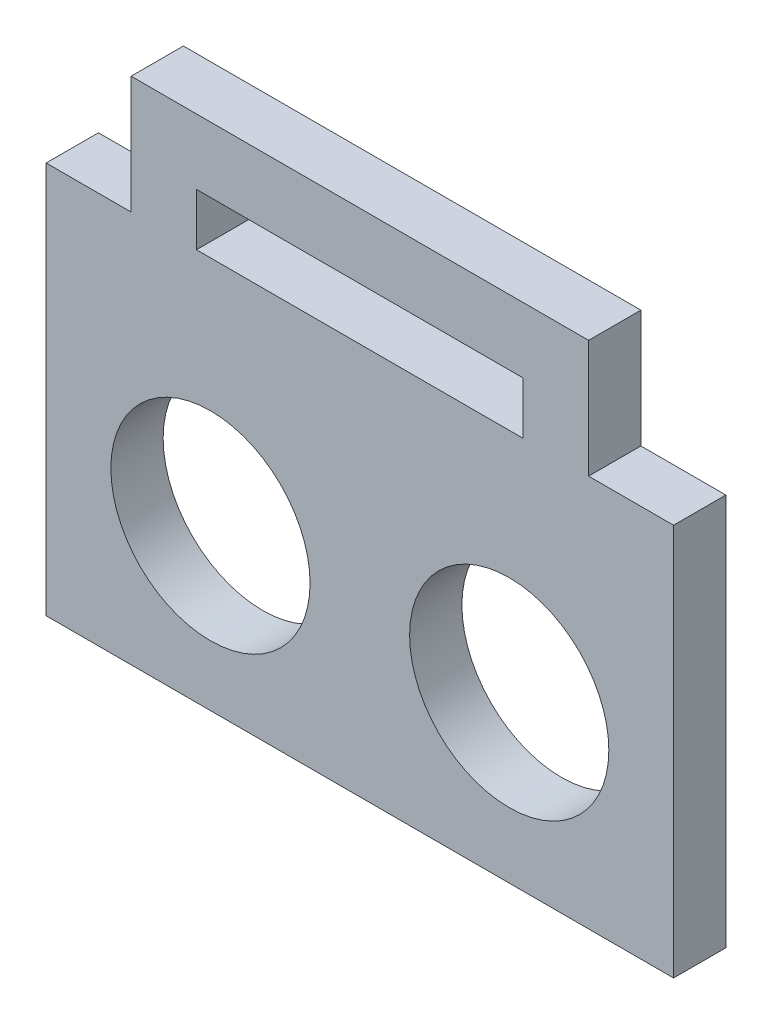
ISO-10303-21;
HEADER;
FILE_DESCRIPTION(('STEP AP214'),'2;1');
FILE_NAME('part.step','',(''),(''),'','','');
FILE_SCHEMA(('AUTOMOTIVE_DESIGN { 1 0 10303 214 1 1 1 1 }'));
ENDSEC;
DATA;
#1=APPLICATION_CONTEXT('core data for automotive mechanical design processes');
#2=APPLICATION_PROTOCOL_DEFINITION('international standard','automotive_design',2000,#1);
#3=PRODUCT_CONTEXT('',#1,'mechanical');
#4=PRODUCT('Part','Part','',(#3));
#5=PRODUCT_RELATED_PRODUCT_CATEGORY('part','',(#4));
#6=PRODUCT_DEFINITION_FORMATION('','',#4);
#7=PRODUCT_DEFINITION_CONTEXT('part definition',#1,'design');
#8=PRODUCT_DEFINITION('design','',#6,#7);
#9=PRODUCT_DEFINITION_SHAPE('','',#8);
#10=(LENGTH_UNIT() NAMED_UNIT(*) SI_UNIT(.MILLI.,.METRE.));
#11=(NAMED_UNIT(*) PLANE_ANGLE_UNIT() SI_UNIT($,.RADIAN.));
#12=(NAMED_UNIT(*) SI_UNIT($,.STERADIAN.) SOLID_ANGLE_UNIT());
#13=UNCERTAINTY_MEASURE_WITH_UNIT(LENGTH_MEASURE(1.E-05),#10,'distance_accuracy_value','');
#14=(GEOMETRIC_REPRESENTATION_CONTEXT(3) GLOBAL_UNCERTAINTY_ASSIGNED_CONTEXT((#13)) GLOBAL_UNIT_ASSIGNED_CONTEXT((#10,
#11,#12)) REPRESENTATION_CONTEXT('',''));
#15=CARTESIAN_POINT('',(0.,0.,0.));
#16=DIRECTION('',(0.,0.,1.));
#17=DIRECTION('',(1.,0.,0.));
#18=AXIS2_PLACEMENT_3D('',#15,#16,#17);
#19=CARTESIAN_POINT('',(28.2561387353151,0.,4.));
#20=DIRECTION('',(1.,0.,0.));
#21=DIRECTION('',(0.,0.,-1.));
#22=AXIS2_PLACEMENT_3D('',#19,#20,#21);
#23=PLANE('',#22);
#24=DIRECTION('',(0.,-1.,0.));
#25=VECTOR('',#24,1.);
#26=CARTESIAN_POINT('',(28.2561387353151,0.,0.));
#27=LINE('',#26,#25);
#28=CARTESIAN_POINT('',(28.2561387353151,5.49966306700464,0.));
#29=VERTEX_POINT('',#28);
#30=CARTESIAN_POINT('',(28.2561387353151,-24.5003369329954,0.));
#31=VERTEX_POINT('',#30);
#32=EDGE_CURVE('E213',#29,#31,#27,.T.);
#33=ORIENTED_EDGE('',*,*,#32,.F.);
#34=DIRECTION('',(0.,0.,-1.));
#35=VECTOR('',#34,1.);
#36=CARTESIAN_POINT('',(28.2561387353151,5.49966306700464,4.));
#37=LINE('',#36,#35);
#38=CARTESIAN_POINT('',(28.2561387353151,5.49966306700464,4.));
#39=VERTEX_POINT('',#38);
#40=EDGE_CURVE('E11',#39,#29,#37,.T.);
#41=ORIENTED_EDGE('',*,*,#40,.F.);
#42=DIRECTION('',(0.,-1.,0.));
#43=VECTOR('',#42,1.);
#44=CARTESIAN_POINT('',(28.2561387353151,0.,4.));
#45=LINE('',#44,#43);
#46=CARTESIAN_POINT('',(28.2561387353151,-24.5003369329954,4.));
#47=VERTEX_POINT('',#46);
#48=EDGE_CURVE('E165',#39,#47,#45,.T.);
#49=ORIENTED_EDGE('',*,*,#48,.T.);
#50=DIRECTION('',(0.,0.,-1.));
#51=VECTOR('',#50,1.);
#52=CARTESIAN_POINT('',(28.2561387353151,-24.5003369329954,4.));
#53=LINE('',#52,#51);
#54=EDGE_CURVE('E101',#47,#31,#53,.T.);
#55=ORIENTED_EDGE('',*,*,#54,.T.);
#56=EDGE_LOOP('',(#33,#41,#49,#55));
#57=FACE_BOUND('',#56,.T.);
#58=ADVANCED_FACE('F35',(#57),#23,.T.);
#59=CARTESIAN_POINT('',(0.,5.49966306700464,4.));
#60=DIRECTION('',(0.,1.,0.));
#61=DIRECTION('',(0.,0.,1.));
#62=AXIS2_PLACEMENT_3D('',#59,#60,#61);
#63=PLANE('',#62);
#64=DIRECTION('',(1.,0.,0.));
#65=VECTOR('',#64,1.);
#66=CARTESIAN_POINT('',(0.,5.49966306700464,0.));
#67=LINE('',#66,#65);
#68=CARTESIAN_POINT('',(21.7561387353151,5.49966306700464,0.));
#69=VERTEX_POINT('',#68);
#70=EDGE_CURVE('E208',#69,#29,#67,.T.);
#71=ORIENTED_EDGE('',*,*,#70,.F.);
#72=DIRECTION('',(0.,0.,-1.));
#73=VECTOR('',#72,1.);
#74=CARTESIAN_POINT('',(21.7561387353151,5.49966306700464,4.));
#75=LINE('',#74,#73);
#76=CARTESIAN_POINT('',(21.7561387353151,5.49966306700464,4.));
#77=VERTEX_POINT('',#76);
#78=EDGE_CURVE('E45',#77,#69,#75,.T.);
#79=ORIENTED_EDGE('',*,*,#78,.F.);
#80=DIRECTION('',(1.,0.,0.));
#81=VECTOR('',#80,1.);
#82=CARTESIAN_POINT('',(0.,5.49966306700464,4.));
#83=LINE('',#82,#81);
#84=EDGE_CURVE('E158',#77,#39,#83,.T.);
#85=ORIENTED_EDGE('',*,*,#84,.T.);
#86=ORIENTED_EDGE('',*,*,#40,.T.);
#87=EDGE_LOOP('',(#71,#79,#85,#86));
#88=FACE_BOUND('',#87,.T.);
#89=ADVANCED_FACE('F240',(#88),#63,.T.);
#90=CARTESIAN_POINT('',(21.7561387353151,0.,4.));
#91=DIRECTION('',(-1.,0.,0.));
#92=DIRECTION('',(0.,-1.,0.));
#93=AXIS2_PLACEMENT_3D('',#90,#91,#92);
#94=PLANE('',#93);
#95=DIRECTION('',(0.,1.,0.));
#96=VECTOR('',#95,1.);
#97=CARTESIAN_POINT('',(21.7561387353151,0.,0.));
#98=LINE('',#97,#96);
#99=CARTESIAN_POINT('',(21.7561387353151,14.4996630670046,0.));
#100=VERTEX_POINT('',#99);
#101=EDGE_CURVE('E212',#69,#100,#98,.T.);
#102=ORIENTED_EDGE('',*,*,#101,.T.);
#103=DIRECTION('',(0.,0.,-1.));
#104=VECTOR('',#103,1.);
#105=CARTESIAN_POINT('',(21.7561387353151,14.4996630670046,4.));
#106=LINE('',#105,#104);
#107=CARTESIAN_POINT('',(21.7561387353151,14.4996630670046,4.));
#108=VERTEX_POINT('',#107);
#109=EDGE_CURVE('E181',#108,#100,#106,.T.);
#110=ORIENTED_EDGE('',*,*,#109,.F.);
#111=DIRECTION('',(0.,1.,0.));
#112=VECTOR('',#111,1.);
#113=CARTESIAN_POINT('',(21.7561387353151,0.,4.));
#114=LINE('',#113,#112);
#115=EDGE_CURVE('E164',#77,#108,#114,.T.);
#116=ORIENTED_EDGE('',*,*,#115,.F.);
#117=ORIENTED_EDGE('',*,*,#78,.T.);
#118=EDGE_LOOP('',(#102,#110,#116,#117));
#119=FACE_BOUND('',#118,.T.);
#120=ADVANCED_FACE('F238',(#119),#94,.F.);
#121=CARTESIAN_POINT('',(0.,14.4996630670046,4.));
#122=DIRECTION('',(0.,1.,0.));
#123=DIRECTION('',(0.,0.,1.));
#124=AXIS2_PLACEMENT_3D('',#121,#122,#123);
#125=PLANE('',#124);
#126=DIRECTION('',(1.,0.,0.));
#127=VECTOR('',#126,1.);
#128=CARTESIAN_POINT('',(0.,14.4996630670046,0.));
#129=LINE('',#128,#127);
#130=CARTESIAN_POINT('',(-13.2438612646849,14.4996630670046,0.));
#131=VERTEX_POINT('',#130);
#132=EDGE_CURVE('E217',#131,#100,#129,.T.);
#133=ORIENTED_EDGE('',*,*,#132,.F.);
#134=DIRECTION('',(0.,0.,-1.));
#135=VECTOR('',#134,1.);
#136=CARTESIAN_POINT('',(-13.2438612646849,14.4996630670046,4.));
#137=LINE('',#136,#135);
#138=CARTESIAN_POINT('',(-13.2438612646849,14.4996630670046,4.));
#139=VERTEX_POINT('',#138);
#140=EDGE_CURVE('E179',#139,#131,#137,.T.);
#141=ORIENTED_EDGE('',*,*,#140,.F.);
#142=DIRECTION('',(1.,0.,0.));
#143=VECTOR('',#142,1.);
#144=CARTESIAN_POINT('',(0.,14.4996630670046,4.));
#145=LINE('',#144,#143);
#146=EDGE_CURVE('E160',#139,#108,#145,.T.);
#147=ORIENTED_EDGE('',*,*,#146,.T.);
#148=ORIENTED_EDGE('',*,*,#109,.T.);
#149=EDGE_LOOP('',(#133,#141,#147,#148));
#150=FACE_BOUND('',#149,.T.);
#151=ADVANCED_FACE('F234',(#150),#125,.T.);
#152=CARTESIAN_POINT('',(-13.2438612646849,0.,4.));
#153=DIRECTION('',(-1.,0.,0.));
#154=DIRECTION('',(0.,0.,1.));
#155=AXIS2_PLACEMENT_3D('',#152,#153,#154);
#156=PLANE('',#155);
#157=DIRECTION('',(0.,1.,0.));
#158=VECTOR('',#157,1.);
#159=CARTESIAN_POINT('',(-13.2438612646849,0.,0.));
#160=LINE('',#159,#158);
#161=CARTESIAN_POINT('',(-13.2438612646849,5.49966306700464,0.));
#162=VERTEX_POINT('',#161);
#163=EDGE_CURVE('E210',#162,#131,#160,.T.);
#164=ORIENTED_EDGE('',*,*,#163,.F.);
#165=DIRECTION('',(0.,0.,-1.));
#166=VECTOR('',#165,1.);
#167=CARTESIAN_POINT('',(-13.2438612646849,5.49966306700464,4.));
#168=LINE('',#167,#166);
#169=CARTESIAN_POINT('',(-13.2438612646849,5.49966306700464,4.));
#170=VERTEX_POINT('',#169);
#171=EDGE_CURVE('E145',#170,#162,#168,.T.);
#172=ORIENTED_EDGE('',*,*,#171,.F.);
#173=DIRECTION('',(0.,1.,0.));
#174=VECTOR('',#173,1.);
#175=CARTESIAN_POINT('',(-13.2438612646849,0.,4.));
#176=LINE('',#175,#174);
#177=EDGE_CURVE('E156',#170,#139,#176,.T.);
#178=ORIENTED_EDGE('',*,*,#177,.T.);
#179=ORIENTED_EDGE('',*,*,#140,.T.);
#180=EDGE_LOOP('',(#164,#172,#178,#179));
#181=FACE_BOUND('',#180,.T.);
#182=ADVANCED_FACE('F231',(#181),#156,.T.);
#183=CARTESIAN_POINT('',(-19.7438612646849,5.49966306700464,0.));
#184=VERTEX_POINT('',#183);
#185=EDGE_CURVE('E142',#184,#162,#67,.T.);
#186=ORIENTED_EDGE('',*,*,#185,.F.);
#187=DIRECTION('',(0.,0.,-1.));
#188=VECTOR('',#187,1.);
#189=CARTESIAN_POINT('',(-19.7438612646849,5.49966306700464,4.));
#190=LINE('',#189,#188);
#191=CARTESIAN_POINT('',(-19.7438612646849,5.49966306700464,4.));
#192=VERTEX_POINT('',#191);
#193=EDGE_CURVE('E136',#192,#184,#190,.T.);
#194=ORIENTED_EDGE('',*,*,#193,.F.);
#195=EDGE_CURVE('E140',#192,#170,#83,.T.);
#196=ORIENTED_EDGE('',*,*,#195,.T.);
#197=ORIENTED_EDGE('',*,*,#171,.T.);
#198=EDGE_LOOP('',(#186,#194,#196,#197));
#199=FACE_BOUND('',#198,.T.);
#200=ADVANCED_FACE('F138',(#199),#63,.T.);
#201=CARTESIAN_POINT('',(-19.7438612646849,0.,4.));
#202=DIRECTION('',(1.,0.,0.));
#203=DIRECTION('',(0.,1.,0.));
#204=AXIS2_PLACEMENT_3D('',#201,#202,#203);
#205=PLANE('',#204);
#206=DIRECTION('',(0.,-1.,0.));
#207=VECTOR('',#206,1.);
#208=CARTESIAN_POINT('',(-19.7438612646849,0.,0.));
#209=LINE('',#208,#207);
#210=CARTESIAN_POINT('',(-19.7438612646849,-24.5003369329954,0.));
#211=VERTEX_POINT('',#210);
#212=EDGE_CURVE('E170',#184,#211,#209,.T.);
#213=ORIENTED_EDGE('',*,*,#212,.T.);
#214=DIRECTION('',(0.,0.,-1.));
#215=VECTOR('',#214,1.);
#216=CARTESIAN_POINT('',(-19.7438612646849,-24.5003369329954,4.));
#217=LINE('',#216,#215);
#218=CARTESIAN_POINT('',(-19.7438612646849,-24.5003369329954,4.));
#219=VERTEX_POINT('',#218);
#220=EDGE_CURVE('E146',#219,#211,#217,.T.);
#221=ORIENTED_EDGE('',*,*,#220,.F.);
#222=DIRECTION('',(0.,-1.,0.));
#223=VECTOR('',#222,1.);
#224=CARTESIAN_POINT('',(-19.7438612646849,0.,4.));
#225=LINE('',#224,#223);
#226=EDGE_CURVE('E149',#192,#219,#225,.T.);
#227=ORIENTED_EDGE('',*,*,#226,.F.);
#228=ORIENTED_EDGE('',*,*,#193,.T.);
#229=EDGE_LOOP('',(#213,#221,#227,#228));
#230=FACE_BOUND('',#229,.T.);
#231=ADVANCED_FACE('F150',(#230),#205,.F.);
#232=CARTESIAN_POINT('',(-8.2438612646849,5.49966306700464,0.));
#233=VERTEX_POINT('',#232);
#234=CARTESIAN_POINT('',(16.7561387353151,5.49966306700464,0.));
#235=VERTEX_POINT('',#234);
#236=EDGE_CURVE('E202',#233,#235,#67,.T.);
#237=ORIENTED_EDGE('',*,*,#236,.F.);
#238=DIRECTION('',(0.,0.,-1.));
#239=VECTOR('',#238,1.);
#240=CARTESIAN_POINT('',(-8.2438612646849,5.49966306700464,4.));
#241=LINE('',#240,#239);
#242=CARTESIAN_POINT('',(-8.2438612646849,5.49966306700464,4.));
#243=VERTEX_POINT('',#242);
#244=EDGE_CURVE('E39',#243,#233,#241,.T.);
#245=ORIENTED_EDGE('',*,*,#244,.F.);
#246=CARTESIAN_POINT('',(16.7561387353151,5.49966306700464,4.));
#247=VERTEX_POINT('',#246);
#248=EDGE_CURVE('E159',#243,#247,#83,.T.);
#249=ORIENTED_EDGE('',*,*,#248,.T.);
#250=DIRECTION('',(0.,0.,-1.));
#251=VECTOR('',#250,1.);
#252=CARTESIAN_POINT('',(16.7561387353151,5.49966306700464,4.));
#253=LINE('',#252,#251);
#254=EDGE_CURVE('E184',#247,#235,#253,.T.);
#255=ORIENTED_EDGE('',*,*,#254,.T.);
#256=EDGE_LOOP('',(#237,#245,#249,#255));
#257=FACE_BOUND('',#256,.T.);
#258=ADVANCED_FACE('F206',(#257),#63,.T.);
#259=CARTESIAN_POINT('',(-8.2438612646849,0.,4.));
#260=DIRECTION('',(-1.,0.,0.));
#261=DIRECTION('',(0.,0.,1.));
#262=AXIS2_PLACEMENT_3D('',#259,#260,#261);
#263=PLANE('',#262);
#264=DIRECTION('',(0.,1.,0.));
#265=VECTOR('',#264,1.);
#266=CARTESIAN_POINT('',(-8.2438612646849,0.,0.));
#267=LINE('',#266,#265);
#268=CARTESIAN_POINT('',(-8.2438612646849,9.49966306700464,0.));
#269=VERTEX_POINT('',#268);
#270=EDGE_CURVE('E195',#233,#269,#267,.T.);
#271=ORIENTED_EDGE('',*,*,#270,.T.);
#272=DIRECTION('',(0.,0.,-1.));
#273=VECTOR('',#272,1.);
#274=CARTESIAN_POINT('',(-8.2438612646849,9.49966306700464,4.));
#275=LINE('',#274,#273);
#276=CARTESIAN_POINT('',(-8.2438612646849,9.49966306700464,4.));
#277=VERTEX_POINT('',#276);
#278=EDGE_CURVE('E187',#277,#269,#275,.T.);
#279=ORIENTED_EDGE('',*,*,#278,.F.);
#280=DIRECTION('',(0.,1.,0.));
#281=VECTOR('',#280,1.);
#282=CARTESIAN_POINT('',(-8.2438612646849,0.,4.));
#283=LINE('',#282,#281);
#284=EDGE_CURVE('E166',#243,#277,#283,.T.);
#285=ORIENTED_EDGE('',*,*,#284,.F.);
#286=ORIENTED_EDGE('',*,*,#244,.T.);
#287=EDGE_LOOP('',(#271,#279,#285,#286));
#288=FACE_BOUND('',#287,.T.);
#289=ADVANCED_FACE('F37',(#288),#263,.F.);
#290=CARTESIAN_POINT('',(0.,9.49966306700464,4.));
#291=DIRECTION('',(0.,-1.,0.));
#292=DIRECTION('',(1.,0.,0.));
#293=AXIS2_PLACEMENT_3D('',#290,#291,#292);
#294=PLANE('',#293);
#295=DIRECTION('',(-1.,0.,0.));
#296=VECTOR('',#295,1.);
#297=CARTESIAN_POINT('',(0.,9.49966306700464,0.));
#298=LINE('',#297,#296);
#299=CARTESIAN_POINT('',(16.7561387353151,9.49966306700464,0.));
#300=VERTEX_POINT('',#299);
#301=EDGE_CURVE('E204',#300,#269,#298,.T.);
#302=ORIENTED_EDGE('',*,*,#301,.F.);
#303=DIRECTION('',(0.,0.,-1.));
#304=VECTOR('',#303,1.);
#305=CARTESIAN_POINT('',(16.7561387353151,9.49966306700464,4.));
#306=LINE('',#305,#304);
#307=CARTESIAN_POINT('',(16.7561387353151,9.49966306700464,4.));
#308=VERTEX_POINT('',#307);
#309=EDGE_CURVE('E186',#308,#300,#306,.T.);
#310=ORIENTED_EDGE('',*,*,#309,.F.);
#311=DIRECTION('',(-1.,0.,0.));
#312=VECTOR('',#311,1.);
#313=CARTESIAN_POINT('',(0.,9.49966306700464,4.));
#314=LINE('',#313,#312);
#315=EDGE_CURVE('E169',#308,#277,#314,.T.);
#316=ORIENTED_EDGE('',*,*,#315,.T.);
#317=ORIENTED_EDGE('',*,*,#278,.T.);
#318=EDGE_LOOP('',(#302,#310,#316,#317));
#319=FACE_BOUND('',#318,.T.);
#320=ADVANCED_FACE('F255',(#319),#294,.T.);
#321=CARTESIAN_POINT('',(-7.1738612646849,-12.2501684664977,4.));
#322=DIRECTION('',(0.,0.,-1.));
#323=DIRECTION('',(-1.,0.,0.));
#324=AXIS2_PLACEMENT_3D('',#321,#322,#323);
#325=CYLINDRICAL_SURFACE('',#324,7.62);
#326=CARTESIAN_POINT('',(-7.1738612646849,-12.2501684664977,4.));
#327=DIRECTION('',(0.,0.,1.));
#328=DIRECTION('',(1.,0.,0.));
#329=AXIS2_PLACEMENT_3D('',#326,#327,#328);
#330=CIRCLE('',#329,7.62);
#331=CARTESIAN_POINT('',(0.446138735315101,-12.2501684664977,4.));
#332=VERTEX_POINT('',#331);
#333=EDGE_CURVE('E416',#332,#332,#330,.T.);
#334=ORIENTED_EDGE('',*,*,#333,.T.);
#335=EDGE_LOOP('',(#334));
#336=FACE_BOUND('',#335,.T.);
#337=CARTESIAN_POINT('',(-7.1738612646849,-12.2501684664977,0.));
#338=DIRECTION('',(0.,0.,1.));
#339=DIRECTION('',(1.,0.,0.));
#340=AXIS2_PLACEMENT_3D('',#337,#338,#339);
#341=CIRCLE('',#340,7.62);
#342=CARTESIAN_POINT('',(0.446138735315101,-12.2501684664977,0.));
#343=VERTEX_POINT('',#342);
#344=EDGE_CURVE('E219',#343,#343,#341,.T.);
#345=ORIENTED_EDGE('',*,*,#344,.F.);
#346=EDGE_LOOP('',(#345));
#347=FACE_BOUND('',#346,.T.);
#348=ADVANCED_FACE('F251',(#336,#347),#325,.F.);
#349=CARTESIAN_POINT('',(15.6831469524206,-11.8803369329954,4.));
#350=DIRECTION('',(0.,0.,-1.));
#351=DIRECTION('',(-1.,0.,0.));
#352=AXIS2_PLACEMENT_3D('',#349,#350,#351);
#353=CYLINDRICAL_SURFACE('',#352,7.62);
#354=CARTESIAN_POINT('',(15.6831469524206,-11.8803369329954,4.));
#355=DIRECTION('',(0.,0.,1.));
#356=DIRECTION('',(1.,0.,0.));
#357=AXIS2_PLACEMENT_3D('',#354,#355,#356);
#358=CIRCLE('',#357,7.62);
#359=CARTESIAN_POINT('',(23.3031469524206,-11.8803369329954,4.));
#360=VERTEX_POINT('',#359);
#361=EDGE_CURVE('E413',#360,#360,#358,.T.);
#362=ORIENTED_EDGE('',*,*,#361,.T.);
#363=EDGE_LOOP('',(#362));
#364=FACE_BOUND('',#363,.T.);
#365=CARTESIAN_POINT('',(15.6831469524206,-11.8803369329954,0.));
#366=DIRECTION('',(0.,0.,1.));
#367=DIRECTION('',(1.,0.,0.));
#368=AXIS2_PLACEMENT_3D('',#365,#366,#367);
#369=CIRCLE('',#368,7.62);
#370=CARTESIAN_POINT('',(23.3031469524206,-11.8803369329954,0.));
#371=VERTEX_POINT('',#370);
#372=EDGE_CURVE('E222',#371,#371,#369,.T.);
#373=ORIENTED_EDGE('',*,*,#372,.F.);
#374=EDGE_LOOP('',(#373));
#375=FACE_BOUND('',#374,.T.);
#376=ADVANCED_FACE('F254',(#364,#375),#353,.F.);
#377=CARTESIAN_POINT('',(16.7561387353151,0.,4.));
#378=DIRECTION('',(-1.,0.,0.));
#379=DIRECTION('',(0.,0.,1.));
#380=AXIS2_PLACEMENT_3D('',#377,#378,#379);
#381=PLANE('',#380);
#382=DIRECTION('',(0.,1.,0.));
#383=VECTOR('',#382,1.);
#384=CARTESIAN_POINT('',(16.7561387353151,0.,0.));
#385=LINE('',#384,#383);
#386=EDGE_CURVE('E269',#235,#300,#385,.T.);
#387=ORIENTED_EDGE('',*,*,#386,.F.);
#388=ORIENTED_EDGE('',*,*,#254,.F.);
#389=DIRECTION('',(0.,1.,0.));
#390=VECTOR('',#389,1.);
#391=CARTESIAN_POINT('',(16.7561387353151,0.,4.));
#392=LINE('',#391,#390);
#393=EDGE_CURVE('E419',#247,#308,#392,.T.);
#394=ORIENTED_EDGE('',*,*,#393,.T.);
#395=ORIENTED_EDGE('',*,*,#309,.T.);
#396=EDGE_LOOP('',(#387,#388,#394,#395));
#397=FACE_BOUND('',#396,.T.);
#398=ADVANCED_FACE('F259',(#397),#381,.T.);
#399=CARTESIAN_POINT('',(0.,-24.5003369329954,4.));
#400=DIRECTION('',(0.,1.,0.));
#401=DIRECTION('',(0.,0.,1.));
#402=AXIS2_PLACEMENT_3D('',#399,#400,#401);
#403=PLANE('',#402);
#404=DIRECTION('',(1.,0.,0.));
#405=VECTOR('',#404,1.);
#406=CARTESIAN_POINT('',(0.,-24.5003369329954,0.));
#407=LINE('',#406,#405);
#408=EDGE_CURVE('E94',#211,#31,#407,.T.);
#409=ORIENTED_EDGE('',*,*,#408,.T.);
#410=ORIENTED_EDGE('',*,*,#54,.F.);
#411=DIRECTION('',(1.,0.,0.));
#412=VECTOR('',#411,1.);
#413=CARTESIAN_POINT('',(0.,-24.5003369329954,4.));
#414=LINE('',#413,#412);
#415=EDGE_CURVE('E54',#219,#47,#414,.T.);
#416=ORIENTED_EDGE('',*,*,#415,.F.);
#417=ORIENTED_EDGE('',*,*,#220,.T.);
#418=EDGE_LOOP('',(#409,#410,#416,#417));
#419=FACE_BOUND('',#418,.T.);
#420=ADVANCED_FACE('F262',(#419),#403,.F.);
#421=CARTESIAN_POINT('',(0.,0.,4.));
#422=DIRECTION('',(0.,0.,1.));
#423=DIRECTION('',(1.,0.,0.));
#424=AXIS2_PLACEMENT_3D('',#421,#422,#423);
#425=PLANE('',#424);
#426=ORIENTED_EDGE('',*,*,#248,.F.);
#427=ORIENTED_EDGE('',*,*,#284,.T.);
#428=ORIENTED_EDGE('',*,*,#315,.F.);
#429=ORIENTED_EDGE('',*,*,#393,.F.);
#430=EDGE_LOOP('',(#426,#427,#428,#429));
#431=FACE_BOUND('',#430,.T.);
#432=ORIENTED_EDGE('',*,*,#361,.F.);
#433=EDGE_LOOP('',(#432));
#434=FACE_BOUND('',#433,.T.);
#435=ORIENTED_EDGE('',*,*,#333,.F.);
#436=EDGE_LOOP('',(#435));
#437=FACE_BOUND('',#436,.T.);
#438=ORIENTED_EDGE('',*,*,#48,.F.);
#439=ORIENTED_EDGE('',*,*,#84,.F.);
#440=ORIENTED_EDGE('',*,*,#115,.T.);
#441=ORIENTED_EDGE('',*,*,#146,.F.);
#442=ORIENTED_EDGE('',*,*,#177,.F.);
#443=ORIENTED_EDGE('',*,*,#195,.F.);
#444=ORIENTED_EDGE('',*,*,#226,.T.);
#445=ORIENTED_EDGE('',*,*,#415,.T.);
#446=EDGE_LOOP('',(#438,#439,#440,#441,#442,#443,#444,#445));
#447=FACE_BOUND('',#446,.T.);
#448=ADVANCED_FACE('F153',(#431,#434,#437,#447),#425,.T.);
#449=CARTESIAN_POINT('',(0.,0.,0.));
#450=DIRECTION('',(0.,0.,1.));
#451=DIRECTION('',(1.,0.,0.));
#452=AXIS2_PLACEMENT_3D('',#449,#450,#451);
#453=PLANE('',#452);
#454=ORIENTED_EDGE('',*,*,#236,.T.);
#455=ORIENTED_EDGE('',*,*,#386,.T.);
#456=ORIENTED_EDGE('',*,*,#301,.T.);
#457=ORIENTED_EDGE('',*,*,#270,.F.);
#458=EDGE_LOOP('',(#454,#455,#456,#457));
#459=FACE_BOUND('',#458,.T.);
#460=ORIENTED_EDGE('',*,*,#372,.T.);
#461=EDGE_LOOP('',(#460));
#462=FACE_BOUND('',#461,.T.);
#463=ORIENTED_EDGE('',*,*,#344,.T.);
#464=EDGE_LOOP('',(#463));
#465=FACE_BOUND('',#464,.T.);
#466=ORIENTED_EDGE('',*,*,#32,.T.);
#467=ORIENTED_EDGE('',*,*,#408,.F.);
#468=ORIENTED_EDGE('',*,*,#212,.F.);
#469=ORIENTED_EDGE('',*,*,#185,.T.);
#470=ORIENTED_EDGE('',*,*,#163,.T.);
#471=ORIENTED_EDGE('',*,*,#132,.T.);
#472=ORIENTED_EDGE('',*,*,#101,.F.);
#473=ORIENTED_EDGE('',*,*,#70,.T.);
#474=EDGE_LOOP('',(#466,#467,#468,#469,#470,#471,#472,#473));
#475=FACE_BOUND('',#474,.T.);
#476=ADVANCED_FACE('F199',(#459,#462,#465,#475),#453,.F.);
#477=CLOSED_SHELL('',(#58,#89,#120,#151,#182,#200,#231,#258,#289,#320,#348,#376,#398,#420,#448,#476));
#478=MANIFOLD_SOLID_BREP('B2',#477);
#479=ADVANCED_BREP_SHAPE_REPRESENTATION('',(#18,#478),#14);
#480=SHAPE_DEFINITION_REPRESENTATION(#9,#479);
ENDSEC;
END-ISO-10303-21;
